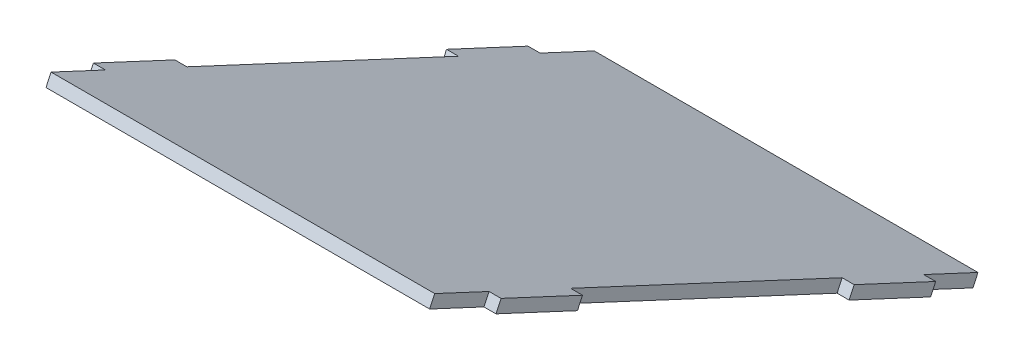
ISO-10303-21;
HEADER;
FILE_DESCRIPTION(('STEP AP214'),'2;1');
FILE_NAME('part.step','',(''),(''),'','','');
FILE_SCHEMA(('AUTOMOTIVE_DESIGN { 1 0 10303 214 1 1 1 1 }'));
ENDSEC;
DATA;
#1=APPLICATION_CONTEXT('core data for automotive mechanical design processes');
#2=APPLICATION_PROTOCOL_DEFINITION('international standard','automotive_design',2000,#1);
#3=PRODUCT_CONTEXT('',#1,'mechanical');
#4=PRODUCT('Part','Part','',(#3));
#5=PRODUCT_RELATED_PRODUCT_CATEGORY('part','',(#4));
#6=PRODUCT_DEFINITION_FORMATION('','',#4);
#7=PRODUCT_DEFINITION_CONTEXT('part definition',#1,'design');
#8=PRODUCT_DEFINITION('design','',#6,#7);
#9=PRODUCT_DEFINITION_SHAPE('','',#8);
#10=(LENGTH_UNIT() NAMED_UNIT(*) SI_UNIT(.MILLI.,.METRE.));
#11=(NAMED_UNIT(*) PLANE_ANGLE_UNIT() SI_UNIT($,.RADIAN.));
#12=(NAMED_UNIT(*) SI_UNIT($,.STERADIAN.) SOLID_ANGLE_UNIT());
#13=UNCERTAINTY_MEASURE_WITH_UNIT(LENGTH_MEASURE(1.E-05),#10,'distance_accuracy_value','');
#14=(GEOMETRIC_REPRESENTATION_CONTEXT(3) GLOBAL_UNCERTAINTY_ASSIGNED_CONTEXT((#13)) GLOBAL_UNIT_ASSIGNED_CONTEXT((#10,
#11,#12)) REPRESENTATION_CONTEXT('',''));
#15=CARTESIAN_POINT('',(0.,0.,0.));
#16=DIRECTION('',(0.,0.,1.));
#17=DIRECTION('',(1.,0.,0.));
#18=AXIS2_PLACEMENT_3D('',#15,#16,#17);
#19=CARTESIAN_POINT('',(36.0000000000003,-4.41356704333373,-19.9083143938479));
#20=DIRECTION('',(0.,-0.422618261740696,-0.906307787036652));
#21=DIRECTION('',(-1.00000000000001,0.,0.));
#22=AXIS2_PLACEMENT_3D('',#19,#20,#21);
#23=PLANE('',#22);
#24=DIRECTION('',(0.,0.90630778703666,-0.4226182617407));
#25=VECTOR('',#24,1.);
#26=CARTESIAN_POINT('',(32.0000000000003,-4.41356704333379,-19.9083143938479));
#27=LINE('',#26,#25);
#28=CARTESIAN_POINT('',(32.0000000000003,-6.22618261740715,-19.0630778703666));
#29=VERTEX_POINT('',#28);
#30=CARTESIAN_POINT('',(32.0000000000003,-4.41356704333379,-19.9083143938479));
#31=VERTEX_POINT('',#30);
#32=EDGE_CURVE('E12',#29,#31,#27,.T.);
#33=ORIENTED_EDGE('',*,*,#32,.F.);
#34=DIRECTION('',(1.00000000000001,0.,0.));
#35=VECTOR('',#34,1.);
#36=CARTESIAN_POINT('',(32.0000000000003,-6.22618261740715,-19.0630778703666));
#37=LINE('',#36,#35);
#38=CARTESIAN_POINT('',(34.0000000000004,-6.22618261740716,-19.0630778703666));
#39=VERTEX_POINT('',#38);
#40=EDGE_CURVE('E153',#39,#29,#37,.F.);
#41=ORIENTED_EDGE('',*,*,#40,.F.);
#42=DIRECTION('',(0.,0.90630778703666,-0.4226182617407));
#43=VECTOR('',#42,1.);
#44=CARTESIAN_POINT('',(34.0000000000003,-4.41356704333379,-19.9083143938479));
#45=LINE('',#44,#43);
#46=CARTESIAN_POINT('',(34.0000000000003,-4.41356704333379,-19.9083143938479));
#47=VERTEX_POINT('',#46);
#48=EDGE_CURVE('E59',#39,#47,#45,.T.);
#49=ORIENTED_EDGE('',*,*,#48,.T.);
#50=DIRECTION('',(-1.00000000000001,0.,0.));
#51=VECTOR('',#50,1.);
#52=CARTESIAN_POINT('',(36.0000000000003,-4.41356704333373,-19.9083143938479));
#53=LINE('',#52,#51);
#54=EDGE_CURVE('E285',#47,#31,#53,.T.);
#55=ORIENTED_EDGE('',*,*,#54,.T.);
#56=EDGE_LOOP('',(#33,#41,#49,#55));
#57=FACE_BOUND('',#56,.T.);
#58=ADVANCED_FACE('F50',(#57),#23,.F.);
#59=CARTESIAN_POINT('',(34.0000000000003,-4.41356704333379,-19.9083143938479));
#60=DIRECTION('',(-1.,0.,0.));
#61=DIRECTION('',(0.,0.422618261740705,0.90630778703665));
#62=AXIS2_PLACEMENT_3D('',#59,#60,#61);
#63=PLANE('',#62);
#64=ORIENTED_EDGE('',*,*,#48,.F.);
#65=DIRECTION('',(0.,0.422618261740705,0.906307787036649));
#66=VECTOR('',#65,1.);
#67=CARTESIAN_POINT('',(34.0000000000003,-2.00000000000008,-10.));
#68=LINE('',#67,#66);
#69=CARTESIAN_POINT('',(34.0000000000003,-12.5654565435177,-32.6576946759163));
#70=VERTEX_POINT('',#69);
#71=EDGE_CURVE('E228',#70,#39,#68,.T.);
#72=ORIENTED_EDGE('',*,*,#71,.F.);
#73=DIRECTION('',(0.,0.90630778703666,-0.4226182617407));
#74=VECTOR('',#73,1.);
#75=CARTESIAN_POINT('',(34.0000000000003,-10.7528409694442,-33.5029311993977));
#76=LINE('',#75,#74);
#77=CARTESIAN_POINT('',(34.0000000000003,-10.7528409694442,-33.5029311993977));
#78=VERTEX_POINT('',#77);
#79=EDGE_CURVE('E278',#70,#78,#76,.T.);
#80=ORIENTED_EDGE('',*,*,#79,.T.);
#81=DIRECTION('',(0.,0.422618261740705,0.90630778703665));
#82=VECTOR('',#81,1.);
#83=CARTESIAN_POINT('',(34.0000000000003,-4.41356704333379,-19.9083143938479));
#84=LINE('',#83,#82);
#85=EDGE_CURVE('E295',#78,#47,#84,.T.);
#86=ORIENTED_EDGE('',*,*,#85,.T.);
#87=EDGE_LOOP('',(#64,#72,#80,#86));
#88=FACE_BOUND('',#87,.T.);
#89=ADVANCED_FACE('F299',(#88),#63,.F.);
#90=CARTESIAN_POINT('',(36.0000000000003,-10.7528409694442,-33.5029311993977));
#91=DIRECTION('',(0.,-0.422618261740696,-0.906307787036652));
#92=DIRECTION('',(-1.00000000000001,0.,0.));
#93=AXIS2_PLACEMENT_3D('',#90,#91,#92);
#94=PLANE('',#93);
#95=ORIENTED_EDGE('',*,*,#79,.F.);
#96=DIRECTION('',(1.00000000000001,0.,0.));
#97=VECTOR('',#96,1.);
#98=CARTESIAN_POINT('',(32.0000000000003,-12.5654565435177,-32.6576946759163));
#99=LINE('',#98,#97);
#100=CARTESIAN_POINT('',(32.0000000000003,-12.5654565435177,-32.6576946759163));
#101=VERTEX_POINT('',#100);
#102=EDGE_CURVE('E224',#70,#101,#99,.F.);
#103=ORIENTED_EDGE('',*,*,#102,.T.);
#104=DIRECTION('',(0.,0.90630778703666,-0.4226182617407));
#105=VECTOR('',#104,1.);
#106=CARTESIAN_POINT('',(32.0000000000003,-10.7528409694443,-33.5029311993977));
#107=LINE('',#106,#105);
#108=CARTESIAN_POINT('',(32.0000000000003,-10.7528409694443,-33.5029311993977));
#109=VERTEX_POINT('',#108);
#110=EDGE_CURVE('E275',#101,#109,#107,.T.);
#111=ORIENTED_EDGE('',*,*,#110,.T.);
#112=DIRECTION('',(-1.00000000000001,0.,0.));
#113=VECTOR('',#112,1.);
#114=CARTESIAN_POINT('',(36.0000000000003,-10.7528409694442,-33.5029311993977));
#115=LINE('',#114,#113);
#116=EDGE_CURVE('E301',#78,#109,#115,.T.);
#117=ORIENTED_EDGE('',*,*,#116,.F.);
#118=EDGE_LOOP('',(#95,#103,#111,#117));
#119=FACE_BOUND('',#118,.T.);
#120=ADVANCED_FACE('F419',(#119),#94,.T.);
#121=CARTESIAN_POINT('',(32.0000000000003,-0.187384425926751,-10.8452365234814));
#122=DIRECTION('',(-1.,0.,0.));
#123=DIRECTION('',(0.,0.422618261740705,0.906307787036649));
#124=AXIS2_PLACEMENT_3D('',#121,#122,#123);
#125=PLANE('',#124);
#126=ORIENTED_EDGE('',*,*,#110,.F.);
#127=DIRECTION('',(0.,0.422618261740705,0.906307787036649));
#128=VECTOR('',#127,1.);
#129=CARTESIAN_POINT('',(32.0000000000004,-2.00000000000007,-10.));
#130=LINE('',#129,#128);
#131=CARTESIAN_POINT('',(32.0000000000002,-33.6963696305532,-77.9730840277493));
#132=VERTEX_POINT('',#131);
#133=EDGE_CURVE('E220',#101,#132,#130,.F.);
#134=ORIENTED_EDGE('',*,*,#133,.T.);
#135=DIRECTION('',(0.,0.90630778703666,-0.4226182617407));
#136=VECTOR('',#135,1.);
#137=CARTESIAN_POINT('',(32.0000000000002,-31.8837540564801,-78.8183205512303));
#138=LINE('',#137,#136);
#139=CARTESIAN_POINT('',(32.0000000000002,-31.8837540564801,-78.8183205512303));
#140=VERTEX_POINT('',#139);
#141=EDGE_CURVE('E272',#132,#140,#138,.T.);
#142=ORIENTED_EDGE('',*,*,#141,.T.);
#143=DIRECTION('',(0.,0.422618261740705,0.906307787036649));
#144=VECTOR('',#143,1.);
#145=CARTESIAN_POINT('',(32.0000000000003,-0.187384425926751,-10.8452365234814));
#146=LINE('',#145,#144);
#147=EDGE_CURVE('E305',#109,#140,#146,.F.);
#148=ORIENTED_EDGE('',*,*,#147,.F.);
#149=EDGE_LOOP('',(#126,#134,#142,#148));
#150=FACE_BOUND('',#149,.T.);
#151=ADVANCED_FACE('F426',(#150),#125,.F.);
#152=CARTESIAN_POINT('',(36.0000000000001,-31.8837540564801,-78.8183205512303));
#153=DIRECTION('',(0.,-0.422618261740696,-0.906307787036652));
#154=DIRECTION('',(-1.00000000000001,0.,0.));
#155=AXIS2_PLACEMENT_3D('',#152,#153,#154);
#156=PLANE('',#155);
#157=ORIENTED_EDGE('',*,*,#141,.F.);
#158=DIRECTION('',(1.00000000000001,0.,0.));
#159=VECTOR('',#158,1.);
#160=CARTESIAN_POINT('',(32.0000000000002,-33.6963696305532,-77.9730840277492));
#161=LINE('',#160,#159);
#162=CARTESIAN_POINT('',(34.0000000000002,-33.6963696305532,-77.9730840277492));
#163=VERTEX_POINT('',#162);
#164=EDGE_CURVE('E216',#163,#132,#161,.F.);
#165=ORIENTED_EDGE('',*,*,#164,.F.);
#166=DIRECTION('',(0.,0.90630778703666,-0.4226182617407));
#167=VECTOR('',#166,1.);
#168=CARTESIAN_POINT('',(34.0000000000001,-31.8837540564801,-78.8183205512302));
#169=LINE('',#168,#167);
#170=CARTESIAN_POINT('',(34.0000000000001,-31.8837540564801,-78.8183205512302));
#171=VERTEX_POINT('',#170);
#172=EDGE_CURVE('E269',#163,#171,#169,.T.);
#173=ORIENTED_EDGE('',*,*,#172,.T.);
#174=DIRECTION('',(-1.00000000000001,0.,0.));
#175=VECTOR('',#174,1.);
#176=CARTESIAN_POINT('',(36.0000000000001,-31.8837540564801,-78.8183205512303));
#177=LINE('',#176,#175);
#178=EDGE_CURVE('E319',#171,#140,#177,.T.);
#179=ORIENTED_EDGE('',*,*,#178,.T.);
#180=EDGE_LOOP('',(#157,#165,#173,#179));
#181=FACE_BOUND('',#180,.T.);
#182=ADVANCED_FACE('F480',(#181),#156,.F.);
#183=CARTESIAN_POINT('',(34.0000000000001,-31.8837540564801,-78.8183205512302));
#184=DIRECTION('',(-1.,0.,0.));
#185=DIRECTION('',(0.,0.422618261740705,0.90630778703665));
#186=AXIS2_PLACEMENT_3D('',#183,#184,#185);
#187=PLANE('',#186);
#188=ORIENTED_EDGE('',*,*,#172,.F.);
#189=DIRECTION('',(0.,0.422618261740705,0.906307787036649));
#190=VECTOR('',#189,1.);
#191=CARTESIAN_POINT('',(34.0000000000003,-2.00000000000008,-10.));
#192=LINE('',#191,#190);
#193=CARTESIAN_POINT('',(34.0000000000002,-40.0356435566638,-91.567700833299));
#194=VERTEX_POINT('',#193);
#195=EDGE_CURVE('E212',#194,#163,#192,.T.);
#196=ORIENTED_EDGE('',*,*,#195,.F.);
#197=DIRECTION('',(0.,0.90630778703666,-0.4226182617407));
#198=VECTOR('',#197,1.);
#199=CARTESIAN_POINT('',(34.0000000000001,-38.2230279825906,-92.4129373567799));
#200=LINE('',#199,#198);
#201=CARTESIAN_POINT('',(34.0000000000001,-38.2230279825906,-92.4129373567799));
#202=VERTEX_POINT('',#201);
#203=EDGE_CURVE('E266',#194,#202,#200,.T.);
#204=ORIENTED_EDGE('',*,*,#203,.T.);
#205=DIRECTION('',(0.,0.422618261740705,0.90630778703665));
#206=VECTOR('',#205,1.);
#207=CARTESIAN_POINT('',(34.0000000000001,-31.8837540564801,-78.8183205512302));
#208=LINE('',#207,#206);
#209=EDGE_CURVE('E323',#202,#171,#208,.T.);
#210=ORIENTED_EDGE('',*,*,#209,.T.);
#211=EDGE_LOOP('',(#188,#196,#204,#210));
#212=FACE_BOUND('',#211,.T.);
#213=ADVANCED_FACE('F483',(#212),#187,.F.);
#214=CARTESIAN_POINT('',(36.0000000000002,-38.2230279825906,-92.4129373567799));
#215=DIRECTION('',(0.,-0.422618261740696,-0.906307787036652));
#216=DIRECTION('',(-1.00000000000001,0.,0.));
#217=AXIS2_PLACEMENT_3D('',#214,#215,#216);
#218=PLANE('',#217);
#219=ORIENTED_EDGE('',*,*,#203,.F.);
#220=DIRECTION('',(1.00000000000001,0.,0.));
#221=VECTOR('',#220,1.);
#222=CARTESIAN_POINT('',(32.0000000000002,-40.0356435566638,-91.567700833299));
#223=LINE('',#222,#221);
#224=CARTESIAN_POINT('',(32.0000000000001,-40.0356435566638,-91.567700833299));
#225=VERTEX_POINT('',#224);
#226=EDGE_CURVE('E208',#194,#225,#223,.F.);
#227=ORIENTED_EDGE('',*,*,#226,.T.);
#228=DIRECTION('',(0.,0.90630778703666,-0.4226182617407));
#229=VECTOR('',#228,1.);
#230=CARTESIAN_POINT('',(32.0000000000001,-38.2230279825906,-92.4129373567799));
#231=LINE('',#230,#229);
#232=CARTESIAN_POINT('',(32.0000000000001,-38.2230279825906,-92.4129373567799));
#233=VERTEX_POINT('',#232);
#234=EDGE_CURVE('E263',#225,#233,#231,.T.);
#235=ORIENTED_EDGE('',*,*,#234,.T.);
#236=DIRECTION('',(-1.00000000000001,0.,0.));
#237=VECTOR('',#236,1.);
#238=CARTESIAN_POINT('',(36.0000000000002,-38.2230279825906,-92.4129373567799));
#239=LINE('',#238,#237);
#240=EDGE_CURVE('E328',#202,#233,#239,.T.);
#241=ORIENTED_EDGE('',*,*,#240,.F.);
#242=EDGE_LOOP('',(#219,#227,#235,#241));
#243=FACE_BOUND('',#242,.T.);
#244=ADVANCED_FACE('F487',(#243),#218,.T.);
#245=ORIENTED_EDGE('',*,*,#234,.F.);
#246=DIRECTION('',(0.,0.422618261740705,0.906307787036649));
#247=VECTOR('',#246,1.);
#248=CARTESIAN_POINT('',(32.0000000000002,-2.00000000000007,-10.));
#249=LINE('',#248,#247);
#250=CARTESIAN_POINT('',(32.0000000000002,-44.2618261740709,-100.630778703666));
#251=VERTEX_POINT('',#250);
#252=EDGE_CURVE('E204',#225,#251,#249,.F.);
#253=ORIENTED_EDGE('',*,*,#252,.T.);
#254=DIRECTION('',(0.,0.90630778703666,-0.4226182617407));
#255=VECTOR('',#254,1.);
#256=CARTESIAN_POINT('',(32.0000000000002,-42.4492105999976,-101.476015227147));
#257=LINE('',#256,#255);
#258=CARTESIAN_POINT('',(32.0000000000002,-42.4492105999976,-101.476015227147));
#259=VERTEX_POINT('',#258);
#260=EDGE_CURVE('E260',#251,#259,#257,.T.);
#261=ORIENTED_EDGE('',*,*,#260,.T.);
#262=EDGE_CURVE('E333',#233,#259,#146,.F.);
#263=ORIENTED_EDGE('',*,*,#262,.F.);
#264=EDGE_LOOP('',(#245,#253,#261,#263));
#265=FACE_BOUND('',#264,.T.);
#266=ADVANCED_FACE('F491',(#265),#125,.F.);
#267=CARTESIAN_POINT('',(32.0000000000002,-42.4492105999976,-101.476015227147));
#268=DIRECTION('',(0.,0.422618261740696,0.906307787036651));
#269=DIRECTION('',(1.00000000000001,0.,0.));
#270=AXIS2_PLACEMENT_3D('',#267,#268,#269);
#271=PLANE('',#270);
#272=ORIENTED_EDGE('',*,*,#260,.F.);
#273=DIRECTION('',(1.00000000000001,0.,0.));
#274=VECTOR('',#273,1.);
#275=CARTESIAN_POINT('',(32.0000000000002,-44.2618261740709,-100.630778703666));
#276=LINE('',#275,#274);
#277=CARTESIAN_POINT('',(-32.000000000002,-44.2618261740708,-100.630778703666));
#278=VERTEX_POINT('',#277);
#279=EDGE_CURVE('E200',#251,#278,#276,.F.);
#280=ORIENTED_EDGE('',*,*,#279,.T.);
#281=DIRECTION('',(0.,0.90630778703666,-0.4226182617407));
#282=VECTOR('',#281,1.);
#283=CARTESIAN_POINT('',(-32.0000000000005,-42.4492105999976,-101.476015227147));
#284=LINE('',#283,#282);
#285=CARTESIAN_POINT('',(-32.0000000000005,-42.4492105999976,-101.476015227147));
#286=VERTEX_POINT('',#285);
#287=EDGE_CURVE('E257',#278,#286,#284,.T.);
#288=ORIENTED_EDGE('',*,*,#287,.T.);
#289=DIRECTION('',(1.00000000000001,0.,0.));
#290=VECTOR('',#289,1.);
#291=CARTESIAN_POINT('',(32.0000000000002,-42.4492105999976,-101.476015227147));
#292=LINE('',#291,#290);
#293=EDGE_CURVE('E334',#259,#286,#292,.F.);
#294=ORIENTED_EDGE('',*,*,#293,.F.);
#295=EDGE_LOOP('',(#272,#280,#288,#294));
#296=FACE_BOUND('',#295,.T.);
#297=ADVANCED_FACE('F495',(#296),#271,.F.);
#298=CARTESIAN_POINT('',(-32.0000000000004,-0.187384425926695,-10.8452365234814));
#299=DIRECTION('',(-1.,0.,0.));
#300=DIRECTION('',(0.,0.422618261740705,0.906307787036649));
#301=AXIS2_PLACEMENT_3D('',#298,#299,#300);
#302=PLANE('',#301);
#303=ORIENTED_EDGE('',*,*,#287,.F.);
#304=DIRECTION('',(0.,0.422618261740705,0.906307787036649));
#305=VECTOR('',#304,1.);
#306=CARTESIAN_POINT('',(-32.0000000000019,-1.99999999999991,-10.));
#307=LINE('',#306,#305);
#308=CARTESIAN_POINT('',(-32.000000000002,-40.0356435566637,-91.5677008332992));
#309=VERTEX_POINT('',#308);
#310=EDGE_CURVE('E196',#309,#278,#307,.F.);
#311=ORIENTED_EDGE('',*,*,#310,.F.);
#312=DIRECTION('',(0.,0.90630778703666,-0.4226182617407));
#313=VECTOR('',#312,1.);
#314=CARTESIAN_POINT('',(-32.0000000000005,-38.2230279825906,-92.41293735678));
#315=LINE('',#314,#313);
#316=CARTESIAN_POINT('',(-32.0000000000005,-38.2230279825906,-92.41293735678));
#317=VERTEX_POINT('',#316);
#318=EDGE_CURVE('E254',#309,#317,#315,.T.);
#319=ORIENTED_EDGE('',*,*,#318,.T.);
#320=DIRECTION('',(0.,0.422618261740705,0.906307787036649));
#321=VECTOR('',#320,1.);
#322=CARTESIAN_POINT('',(-32.0000000000004,-0.187384425926695,-10.8452365234814));
#323=LINE('',#322,#321);
#324=EDGE_CURVE('E346',#317,#286,#323,.F.);
#325=ORIENTED_EDGE('',*,*,#324,.T.);
#326=EDGE_LOOP('',(#303,#311,#319,#325));
#327=FACE_BOUND('',#326,.T.);
#328=ADVANCED_FACE('F443',(#327),#302,.T.);
#329=CARTESIAN_POINT('',(-36.0000000000005,-38.2230279825906,-92.41293735678));
#330=DIRECTION('',(0.,0.422618261740696,0.906307787036652));
#331=DIRECTION('',(1.00000000000001,0.,0.));
#332=AXIS2_PLACEMENT_3D('',#329,#330,#331);
#333=PLANE('',#332);
#334=ORIENTED_EDGE('',*,*,#318,.F.);
#335=DIRECTION('',(1.00000000000001,0.,0.));
#336=VECTOR('',#335,1.);
#337=CARTESIAN_POINT('',(32.0000000000002,-40.0356435566639,-91.5677008332991));
#338=LINE('',#337,#336);
#339=CARTESIAN_POINT('',(-34.000000000002,-40.0356435566637,-91.5677008332991));
#340=VERTEX_POINT('',#339);
#341=EDGE_CURVE('E192',#340,#309,#338,.T.);
#342=ORIENTED_EDGE('',*,*,#341,.F.);
#343=DIRECTION('',(0.,0.90630778703666,-0.4226182617407));
#344=VECTOR('',#343,1.);
#345=CARTESIAN_POINT('',(-34.0000000000005,-38.2230279825906,-92.41293735678));
#346=LINE('',#345,#344);
#347=CARTESIAN_POINT('',(-34.0000000000005,-38.2230279825906,-92.41293735678));
#348=VERTEX_POINT('',#347);
#349=EDGE_CURVE('E251',#340,#348,#346,.T.);
#350=ORIENTED_EDGE('',*,*,#349,.T.);
#351=DIRECTION('',(1.00000000000001,0.,0.));
#352=VECTOR('',#351,1.);
#353=CARTESIAN_POINT('',(-36.0000000000005,-38.2230279825906,-92.41293735678));
#354=LINE('',#353,#352);
#355=EDGE_CURVE('E341',#348,#317,#354,.T.);
#356=ORIENTED_EDGE('',*,*,#355,.T.);
#357=EDGE_LOOP('',(#334,#342,#350,#356));
#358=FACE_BOUND('',#357,.T.);
#359=ADVANCED_FACE('F447',(#358),#333,.F.);
#360=CARTESIAN_POINT('',(-34.0000000000005,-31.8837540564801,-78.8183205512303));
#361=DIRECTION('',(-1.,0.,0.));
#362=DIRECTION('',(0.,0.422618261740705,0.90630778703665));
#363=AXIS2_PLACEMENT_3D('',#360,#361,#362);
#364=PLANE('',#363);
#365=ORIENTED_EDGE('',*,*,#349,.F.);
#366=DIRECTION('',(0.,0.422618261740705,0.906307787036649));
#367=VECTOR('',#366,1.);
#368=CARTESIAN_POINT('',(-34.0000000000019,-1.9999999999999,-10.));
#369=LINE('',#368,#367);
#370=CARTESIAN_POINT('',(-34.000000000002,-33.6963696305531,-77.9730840277494));
#371=VERTEX_POINT('',#370);
#372=EDGE_CURVE('E188',#340,#371,#369,.T.);
#373=ORIENTED_EDGE('',*,*,#372,.T.);
#374=DIRECTION('',(0.,0.90630778703666,-0.4226182617407));
#375=VECTOR('',#374,1.);
#376=CARTESIAN_POINT('',(-34.0000000000005,-31.8837540564801,-78.8183205512303));
#377=LINE('',#376,#375);
#378=CARTESIAN_POINT('',(-34.0000000000005,-31.8837540564801,-78.8183205512303));
#379=VERTEX_POINT('',#378);
#380=EDGE_CURVE('E248',#371,#379,#377,.T.);
#381=ORIENTED_EDGE('',*,*,#380,.T.);
#382=DIRECTION('',(0.,0.422618261740705,0.90630778703665));
#383=VECTOR('',#382,1.);
#384=CARTESIAN_POINT('',(-34.0000000000005,-31.8837540564801,-78.8183205512303));
#385=LINE('',#384,#383);
#386=EDGE_CURVE('E345',#348,#379,#385,.T.);
#387=ORIENTED_EDGE('',*,*,#386,.F.);
#388=EDGE_LOOP('',(#365,#373,#381,#387));
#389=FACE_BOUND('',#388,.T.);
#390=ADVANCED_FACE('F452',(#389),#364,.T.);
#391=CARTESIAN_POINT('',(-36.0000000000005,-31.8837540564801,-78.8183205512303));
#392=DIRECTION('',(0.,0.422618261740696,0.906307787036652));
#393=DIRECTION('',(1.00000000000001,0.,0.));
#394=AXIS2_PLACEMENT_3D('',#391,#392,#393);
#395=PLANE('',#394);
#396=ORIENTED_EDGE('',*,*,#380,.F.);
#397=DIRECTION('',(1.00000000000001,0.,0.));
#398=VECTOR('',#397,1.);
#399=CARTESIAN_POINT('',(32.0000000000002,-33.6963696305533,-77.9730840277494));
#400=LINE('',#399,#398);
#401=CARTESIAN_POINT('',(-32.000000000002,-33.6963696305531,-77.9730840277494));
#402=VERTEX_POINT('',#401);
#403=EDGE_CURVE('E184',#371,#402,#400,.T.);
#404=ORIENTED_EDGE('',*,*,#403,.T.);
#405=DIRECTION('',(0.,0.90630778703666,-0.4226182617407));
#406=VECTOR('',#405,1.);
#407=CARTESIAN_POINT('',(-32.0000000000005,-31.8837540564801,-78.8183205512303));
#408=LINE('',#407,#406);
#409=CARTESIAN_POINT('',(-32.0000000000005,-31.8837540564801,-78.8183205512303));
#410=VERTEX_POINT('',#409);
#411=EDGE_CURVE('E245',#402,#410,#408,.T.);
#412=ORIENTED_EDGE('',*,*,#411,.T.);
#413=DIRECTION('',(1.00000000000001,0.,0.));
#414=VECTOR('',#413,1.);
#415=CARTESIAN_POINT('',(-36.0000000000005,-31.8837540564801,-78.8183205512303));
#416=LINE('',#415,#414);
#417=EDGE_CURVE('E351',#379,#410,#416,.T.);
#418=ORIENTED_EDGE('',*,*,#417,.F.);
#419=EDGE_LOOP('',(#396,#404,#412,#418));
#420=FACE_BOUND('',#419,.T.);
#421=ADVANCED_FACE('F456',(#420),#395,.T.);
#422=ORIENTED_EDGE('',*,*,#411,.F.);
#423=DIRECTION('',(0.,0.422618261740705,0.906307787036649));
#424=VECTOR('',#423,1.);
#425=CARTESIAN_POINT('',(-32.0000000000018,-1.99999999999991,-10.));
#426=LINE('',#425,#424);
#427=CARTESIAN_POINT('',(-32.0000000000018,-12.5654565435176,-32.6576946759164));
#428=VERTEX_POINT('',#427);
#429=EDGE_CURVE('E180',#428,#402,#426,.F.);
#430=ORIENTED_EDGE('',*,*,#429,.F.);
#431=DIRECTION('',(0.,0.90630778703666,-0.4226182617407));
#432=VECTOR('',#431,1.);
#433=CARTESIAN_POINT('',(-32.0000000000004,-10.7528409694442,-33.5029311993977));
#434=LINE('',#433,#432);
#435=CARTESIAN_POINT('',(-32.0000000000004,-10.7528409694442,-33.5029311993977));
#436=VERTEX_POINT('',#435);
#437=EDGE_CURVE('E242',#428,#436,#434,.T.);
#438=ORIENTED_EDGE('',*,*,#437,.T.);
#439=EDGE_CURVE('E356',#436,#410,#323,.F.);
#440=ORIENTED_EDGE('',*,*,#439,.T.);
#441=EDGE_LOOP('',(#422,#430,#438,#440));
#442=FACE_BOUND('',#441,.T.);
#443=ADVANCED_FACE('F458',(#442),#302,.T.);
#444=CARTESIAN_POINT('',(-36.0000000000003,-10.7528409694443,-33.5029311993976));
#445=DIRECTION('',(0.,0.422618261740696,0.906307787036652));
#446=DIRECTION('',(1.00000000000001,0.,0.));
#447=AXIS2_PLACEMENT_3D('',#444,#445,#446);
#448=PLANE('',#447);
#449=ORIENTED_EDGE('',*,*,#437,.F.);
#450=DIRECTION('',(1.00000000000001,0.,0.));
#451=VECTOR('',#450,1.);
#452=CARTESIAN_POINT('',(32.0000000000003,-12.5654565435177,-32.6576946759163));
#453=LINE('',#452,#451);
#454=CARTESIAN_POINT('',(-34.0000000000018,-12.5654565435176,-32.6576946759163));
#455=VERTEX_POINT('',#454);
#456=EDGE_CURVE('E176',#455,#428,#453,.T.);
#457=ORIENTED_EDGE('',*,*,#456,.F.);
#458=DIRECTION('',(0.,0.90630778703666,-0.4226182617407));
#459=VECTOR('',#458,1.);
#460=CARTESIAN_POINT('',(-34.0000000000003,-10.7528409694442,-33.5029311993976));
#461=LINE('',#460,#459);
#462=CARTESIAN_POINT('',(-34.0000000000003,-10.7528409694442,-33.5029311993976));
#463=VERTEX_POINT('',#462);
#464=EDGE_CURVE('E239',#455,#463,#461,.T.);
#465=ORIENTED_EDGE('',*,*,#464,.T.);
#466=DIRECTION('',(1.00000000000001,0.,0.));
#467=VECTOR('',#466,1.);
#468=CARTESIAN_POINT('',(-36.0000000000003,-10.7528409694443,-33.5029311993976));
#469=LINE('',#468,#467);
#470=EDGE_CURVE('E357',#463,#436,#469,.T.);
#471=ORIENTED_EDGE('',*,*,#470,.T.);
#472=EDGE_LOOP('',(#449,#457,#465,#471));
#473=FACE_BOUND('',#472,.T.);
#474=ADVANCED_FACE('F461',(#473),#448,.F.);
#475=CARTESIAN_POINT('',(-34.0000000000003,-4.41356704333379,-19.9083143938479));
#476=DIRECTION('',(-1.,0.,0.));
#477=DIRECTION('',(0.,0.422618261740705,0.90630778703665));
#478=AXIS2_PLACEMENT_3D('',#475,#476,#477);
#479=PLANE('',#478);
#480=ORIENTED_EDGE('',*,*,#464,.F.);
#481=DIRECTION('',(0.,0.422618261740705,0.906307787036649));
#482=VECTOR('',#481,1.);
#483=CARTESIAN_POINT('',(-34.0000000000018,-1.9999999999999,-10.));
#484=LINE('',#483,#482);
#485=CARTESIAN_POINT('',(-34.0000000000018,-6.22618261740699,-19.0630778703666));
#486=VERTEX_POINT('',#485);
#487=EDGE_CURVE('E172',#455,#486,#484,.T.);
#488=ORIENTED_EDGE('',*,*,#487,.T.);
#489=DIRECTION('',(0.,0.90630778703666,-0.4226182617407));
#490=VECTOR('',#489,1.);
#491=CARTESIAN_POINT('',(-34.0000000000003,-4.41356704333379,-19.9083143938479));
#492=LINE('',#491,#490);
#493=CARTESIAN_POINT('',(-34.0000000000003,-4.41356704333379,-19.9083143938479));
#494=VERTEX_POINT('',#493);
#495=EDGE_CURVE('E236',#486,#494,#492,.T.);
#496=ORIENTED_EDGE('',*,*,#495,.T.);
#497=DIRECTION('',(0.,0.422618261740705,0.90630778703665));
#498=VECTOR('',#497,1.);
#499=CARTESIAN_POINT('',(-34.0000000000003,-4.41356704333379,-19.9083143938479));
#500=LINE('',#499,#498);
#501=EDGE_CURVE('E360',#463,#494,#500,.T.);
#502=ORIENTED_EDGE('',*,*,#501,.F.);
#503=EDGE_LOOP('',(#480,#488,#496,#502));
#504=FACE_BOUND('',#503,.T.);
#505=ADVANCED_FACE('F462',(#504),#479,.T.);
#506=CARTESIAN_POINT('',(-36.0000000000003,-4.41356704333373,-19.9083143938479));
#507=DIRECTION('',(0.,0.422618261740696,0.906307787036652));
#508=DIRECTION('',(1.00000000000001,0.,0.));
#509=AXIS2_PLACEMENT_3D('',#506,#507,#508);
#510=PLANE('',#509);
#511=ORIENTED_EDGE('',*,*,#495,.F.);
#512=DIRECTION('',(1.00000000000001,0.,0.));
#513=VECTOR('',#512,1.);
#514=CARTESIAN_POINT('',(32.0000000000003,-6.22618261740716,-19.0630778703666));
#515=LINE('',#514,#513);
#516=CARTESIAN_POINT('',(-32.0000000000018,-6.22618261740701,-19.0630778703666));
#517=VERTEX_POINT('',#516);
#518=EDGE_CURVE('E168',#486,#517,#515,.T.);
#519=ORIENTED_EDGE('',*,*,#518,.T.);
#520=DIRECTION('',(0.,0.90630778703666,-0.4226182617407));
#521=VECTOR('',#520,1.);
#522=CARTESIAN_POINT('',(-32.0000000000003,-4.41356704333373,-19.9083143938479));
#523=LINE('',#522,#521);
#524=CARTESIAN_POINT('',(-32.0000000000003,-4.41356704333373,-19.9083143938479));
#525=VERTEX_POINT('',#524);
#526=EDGE_CURVE('E234',#517,#525,#523,.T.);
#527=ORIENTED_EDGE('',*,*,#526,.T.);
#528=DIRECTION('',(1.00000000000001,0.,0.));
#529=VECTOR('',#528,1.);
#530=CARTESIAN_POINT('',(-36.0000000000003,-4.41356704333373,-19.9083143938479));
#531=LINE('',#530,#529);
#532=EDGE_CURVE('E161',#494,#525,#531,.T.);
#533=ORIENTED_EDGE('',*,*,#532,.F.);
#534=EDGE_LOOP('',(#511,#519,#527,#533));
#535=FACE_BOUND('',#534,.T.);
#536=ADVANCED_FACE('F388',(#535),#510,.T.);
#537=ORIENTED_EDGE('',*,*,#526,.F.);
#538=DIRECTION('',(0.,0.422618261740705,0.906307787036649));
#539=VECTOR('',#538,1.);
#540=CARTESIAN_POINT('',(-32.0000000000018,-1.99999999999991,-10.));
#541=LINE('',#540,#539);
#542=CARTESIAN_POINT('',(-32.0000000000018,-1.99999999999993,-10.));
#543=VERTEX_POINT('',#542);
#544=EDGE_CURVE('E164',#543,#517,#541,.F.);
#545=ORIENTED_EDGE('',*,*,#544,.F.);
#546=DIRECTION('',(0.,0.90630778703666,-0.4226182617407));
#547=VECTOR('',#546,1.);
#548=CARTESIAN_POINT('',(-32.0000000000004,-0.187384425926695,-10.8452365234814));
#549=LINE('',#548,#547);
#550=CARTESIAN_POINT('',(-32.0000000000004,-0.187384425926695,-10.8452365234814));
#551=VERTEX_POINT('',#550);
#552=EDGE_CURVE('E67',#543,#551,#549,.T.);
#553=ORIENTED_EDGE('',*,*,#552,.T.);
#554=EDGE_CURVE('E146',#551,#525,#323,.F.);
#555=ORIENTED_EDGE('',*,*,#554,.T.);
#556=EDGE_LOOP('',(#537,#545,#553,#555));
#557=FACE_BOUND('',#556,.T.);
#558=ADVANCED_FACE('F386',(#557),#302,.T.);
#559=CARTESIAN_POINT('',(32.0000000000003,-0.187384425926751,-10.8452365234814));
#560=DIRECTION('',(0.,0.422618261740696,0.906307787036651));
#561=DIRECTION('',(1.00000000000001,0.,0.));
#562=AXIS2_PLACEMENT_3D('',#559,#560,#561);
#563=PLANE('',#562);
#564=ORIENTED_EDGE('',*,*,#552,.F.);
#565=DIRECTION('',(1.00000000000001,0.,0.));
#566=VECTOR('',#565,1.);
#567=CARTESIAN_POINT('',(32.0000000000003,-2.00000000000007,-10.));
#568=LINE('',#567,#566);
#569=CARTESIAN_POINT('',(32.0000000000003,-2.00000000000007,-10.));
#570=VERTEX_POINT('',#569);
#571=EDGE_CURVE('E151',#570,#543,#568,.F.);
#572=ORIENTED_EDGE('',*,*,#571,.F.);
#573=DIRECTION('',(0.,0.90630778703666,-0.4226182617407));
#574=VECTOR('',#573,1.);
#575=CARTESIAN_POINT('',(32.0000000000003,-0.187384425926751,-10.8452365234814));
#576=LINE('',#575,#574);
#577=CARTESIAN_POINT('',(32.0000000000003,-0.187384425926751,-10.8452365234814));
#578=VERTEX_POINT('',#577);
#579=EDGE_CURVE('E53',#570,#578,#576,.T.);
#580=ORIENTED_EDGE('',*,*,#579,.T.);
#581=DIRECTION('',(1.00000000000001,0.,0.));
#582=VECTOR('',#581,1.);
#583=CARTESIAN_POINT('',(32.0000000000003,-0.187384425926751,-10.8452365234814));
#584=LINE('',#583,#582);
#585=EDGE_CURVE('E167',#578,#551,#584,.F.);
#586=ORIENTED_EDGE('',*,*,#585,.T.);
#587=EDGE_LOOP('',(#564,#572,#580,#586));
#588=FACE_BOUND('',#587,.T.);
#589=ADVANCED_FACE('F156',(#588),#563,.T.);
#590=DIRECTION('',(0.,0.422618261740705,0.906307787036649));
#591=VECTOR('',#590,1.);
#592=CARTESIAN_POINT('',(32.0000000000003,-2.00000000000007,-10.));
#593=LINE('',#592,#591);
#594=EDGE_CURVE('E140',#570,#29,#593,.F.);
#595=ORIENTED_EDGE('',*,*,#594,.T.);
#596=ORIENTED_EDGE('',*,*,#32,.T.);
#597=EDGE_CURVE('E142',#578,#31,#146,.F.);
#598=ORIENTED_EDGE('',*,*,#597,.F.);
#599=ORIENTED_EDGE('',*,*,#579,.F.);
#600=EDGE_LOOP('',(#595,#596,#598,#599));
#601=FACE_BOUND('',#600,.T.);
#602=ADVANCED_FACE('F139',(#601),#125,.F.);
#603=CARTESIAN_POINT('',(32.0000000000003,-0.187384425926751,-10.8452365234814));
#604=DIRECTION('',(0.,0.90630778703666,-0.4226182617407));
#605=DIRECTION('',(0.,0.422618261740705,0.906307787036649));
#606=AXIS2_PLACEMENT_3D('',#603,#604,#605);
#607=PLANE('',#606);
#608=ORIENTED_EDGE('',*,*,#585,.F.);
#609=ORIENTED_EDGE('',*,*,#597,.T.);
#610=ORIENTED_EDGE('',*,*,#54,.F.);
#611=ORIENTED_EDGE('',*,*,#85,.F.);
#612=ORIENTED_EDGE('',*,*,#116,.T.);
#613=ORIENTED_EDGE('',*,*,#147,.T.);
#614=ORIENTED_EDGE('',*,*,#178,.F.);
#615=ORIENTED_EDGE('',*,*,#209,.F.);
#616=ORIENTED_EDGE('',*,*,#240,.T.);
#617=ORIENTED_EDGE('',*,*,#262,.T.);
#618=ORIENTED_EDGE('',*,*,#293,.T.);
#619=ORIENTED_EDGE('',*,*,#324,.F.);
#620=ORIENTED_EDGE('',*,*,#355,.F.);
#621=ORIENTED_EDGE('',*,*,#386,.T.);
#622=ORIENTED_EDGE('',*,*,#417,.T.);
#623=ORIENTED_EDGE('',*,*,#439,.F.);
#624=ORIENTED_EDGE('',*,*,#470,.F.);
#625=ORIENTED_EDGE('',*,*,#501,.T.);
#626=ORIENTED_EDGE('',*,*,#532,.T.);
#627=ORIENTED_EDGE('',*,*,#554,.F.);
#628=EDGE_LOOP('',(#608,#609,#610,#611,#612,#613,#614,#615,#616,#617,#618,#619,#620,#621,#622,
#623,#624,#625,#626,#627));
#629=FACE_BOUND('',#628,.T.);
#630=ADVANCED_FACE('F293',(#629),#607,.T.);
#631=CARTESIAN_POINT('',(32.0000000000003,-2.00000000000007,-10.));
#632=DIRECTION('',(0.,0.90630778703666,-0.4226182617407));
#633=DIRECTION('',(0.,0.422618261740705,0.906307787036649));
#634=AXIS2_PLACEMENT_3D('',#631,#632,#633);
#635=PLANE('',#634);
#636=ORIENTED_EDGE('',*,*,#571,.T.);
#637=ORIENTED_EDGE('',*,*,#544,.T.);
#638=ORIENTED_EDGE('',*,*,#518,.F.);
#639=ORIENTED_EDGE('',*,*,#487,.F.);
#640=ORIENTED_EDGE('',*,*,#456,.T.);
#641=ORIENTED_EDGE('',*,*,#429,.T.);
#642=ORIENTED_EDGE('',*,*,#403,.F.);
#643=ORIENTED_EDGE('',*,*,#372,.F.);
#644=ORIENTED_EDGE('',*,*,#341,.T.);
#645=ORIENTED_EDGE('',*,*,#310,.T.);
#646=ORIENTED_EDGE('',*,*,#279,.F.);
#647=ORIENTED_EDGE('',*,*,#252,.F.);
#648=ORIENTED_EDGE('',*,*,#226,.F.);
#649=ORIENTED_EDGE('',*,*,#195,.T.);
#650=ORIENTED_EDGE('',*,*,#164,.T.);
#651=ORIENTED_EDGE('',*,*,#133,.F.);
#652=ORIENTED_EDGE('',*,*,#102,.F.);
#653=ORIENTED_EDGE('',*,*,#71,.T.);
#654=ORIENTED_EDGE('',*,*,#40,.T.);
#655=ORIENTED_EDGE('',*,*,#594,.F.);
#656=EDGE_LOOP('',(#636,#637,#638,#639,#640,#641,#642,#643,#644,#645,#646,#647,#648,#649,#650,
#651,#652,#653,#654,#655));
#657=FACE_BOUND('',#656,.T.);
#658=ADVANCED_FACE('F149',(#657),#635,.F.);
#659=CLOSED_SHELL('',(#58,#89,#120,#151,#182,#213,#244,#266,#297,#328,#359,#390,#421,#443,#474,
#505,#536,#558,#589,#602,#630,#658));
#660=MANIFOLD_SOLID_BREP('B2',#659);
#661=ADVANCED_BREP_SHAPE_REPRESENTATION('',(#18,#660),#14);
#662=SHAPE_DEFINITION_REPRESENTATION(#9,#661);
ENDSEC;
END-ISO-10303-21;
